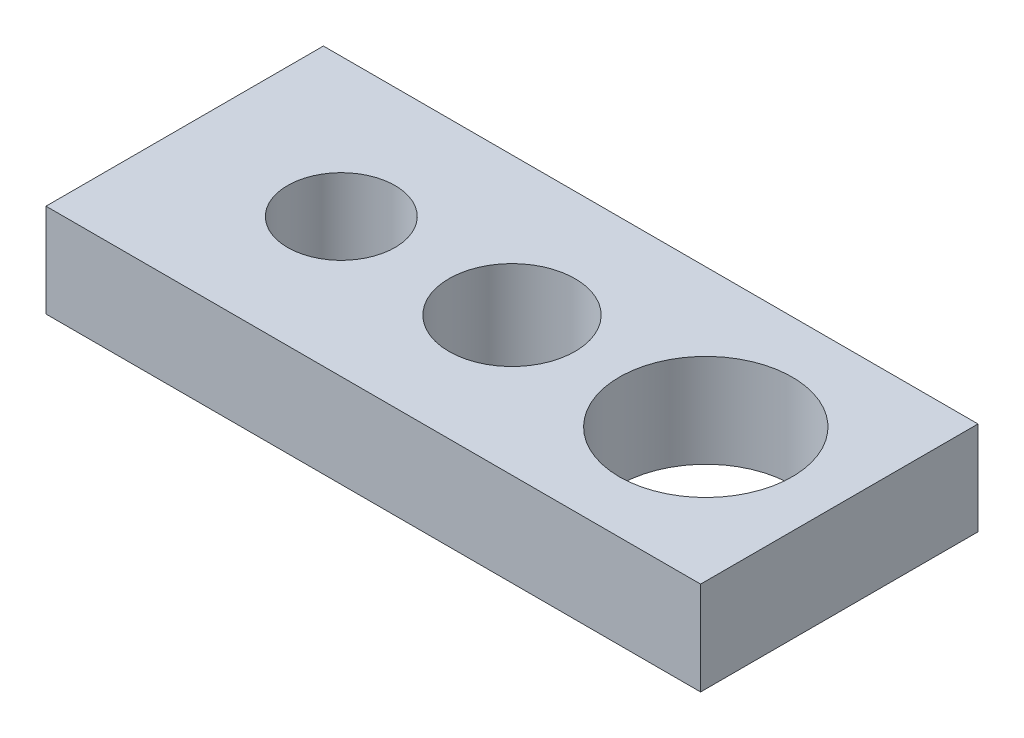
ISO-10303-21;
HEADER;
FILE_DESCRIPTION(('STEP AP214'),'2;1');
FILE_NAME('part.step','',(''),(''),'','','');
FILE_SCHEMA(('AUTOMOTIVE_DESIGN { 1 0 10303 214 1 1 1 1 }'));
ENDSEC;
DATA;
#1=APPLICATION_CONTEXT('core data for automotive mechanical design processes');
#2=APPLICATION_PROTOCOL_DEFINITION('international standard','automotive_design',2000,#1);
#3=PRODUCT_CONTEXT('',#1,'mechanical');
#4=PRODUCT('Part','Part','',(#3));
#5=PRODUCT_RELATED_PRODUCT_CATEGORY('part','',(#4));
#6=PRODUCT_DEFINITION_FORMATION('','',#4);
#7=PRODUCT_DEFINITION_CONTEXT('part definition',#1,'design');
#8=PRODUCT_DEFINITION('design','',#6,#7);
#9=PRODUCT_DEFINITION_SHAPE('','',#8);
#10=(LENGTH_UNIT() NAMED_UNIT(*) SI_UNIT(.MILLI.,.METRE.));
#11=(NAMED_UNIT(*) PLANE_ANGLE_UNIT() SI_UNIT($,.RADIAN.));
#12=(NAMED_UNIT(*) SI_UNIT($,.STERADIAN.) SOLID_ANGLE_UNIT());
#13=UNCERTAINTY_MEASURE_WITH_UNIT(LENGTH_MEASURE(1.E-05),#10,'distance_accuracy_value','');
#14=(GEOMETRIC_REPRESENTATION_CONTEXT(3) GLOBAL_UNCERTAINTY_ASSIGNED_CONTEXT((#13)) GLOBAL_UNIT_ASSIGNED_CONTEXT((#10,
#11,#12)) REPRESENTATION_CONTEXT('',''));
#15=CARTESIAN_POINT('',(0.,0.,0.));
#16=DIRECTION('',(0.,0.,1.));
#17=DIRECTION('',(1.,0.,0.));
#18=AXIS2_PLACEMENT_3D('',#15,#16,#17);
#19=CARTESIAN_POINT('',(0.,2.,0.));
#20=DIRECTION('',(0.,1.,0.));
#21=DIRECTION('',(0.,0.,1.));
#22=AXIS2_PLACEMENT_3D('',#19,#20,#21);
#23=PLANE('',#22);
#24=CARTESIAN_POINT('',(0.,2.,0.));
#25=DIRECTION('',(0.,1.,0.));
#26=DIRECTION('',(0.,0.,1.));
#27=AXIS2_PLACEMENT_3D('',#24,#25,#26);
#28=CIRCLE('',#27,1.35);
#29=CARTESIAN_POINT('',(0.,2.,1.35));
#30=VERTEX_POINT('',#29);
#31=EDGE_CURVE('E134',#30,#30,#28,.T.);
#32=ORIENTED_EDGE('',*,*,#31,.F.);
#33=EDGE_LOOP('',(#32));
#34=FACE_BOUND('',#33,.T.);
#35=DIRECTION('',(0.,0.,-1.));
#36=VECTOR('',#35,1.);
#37=CARTESIAN_POINT('',(7.00569419664908,2.,-2.96881271883403));
#38=LINE('',#37,#36);
#39=CARTESIAN_POINT('',(7.00569419664908,2.,2.96881271883403));
#40=VERTEX_POINT('',#39);
#41=CARTESIAN_POINT('',(7.00569419664908,2.,-2.96881271883403));
#42=VERTEX_POINT('',#41);
#43=EDGE_CURVE('E92',#40,#42,#38,.T.);
#44=ORIENTED_EDGE('',*,*,#43,.T.);
#45=DIRECTION('',(-1.,0.,0.));
#46=VECTOR('',#45,1.);
#47=CARTESIAN_POINT('',(-7.00569419664908,2.,-2.96881271883403));
#48=LINE('',#47,#46);
#49=CARTESIAN_POINT('',(-7.00569419664908,2.,-2.96881271883403));
#50=VERTEX_POINT('',#49);
#51=EDGE_CURVE('E87',#42,#50,#48,.T.);
#52=ORIENTED_EDGE('',*,*,#51,.T.);
#53=DIRECTION('',(0.,0.,1.));
#54=VECTOR('',#53,1.);
#55=CARTESIAN_POINT('',(-7.00569419664908,2.,-2.96881271883403));
#56=LINE('',#55,#54);
#57=CARTESIAN_POINT('',(-7.00569419664908,2.,2.96881271883403));
#58=VERTEX_POINT('',#57);
#59=EDGE_CURVE('E90',#50,#58,#56,.T.);
#60=ORIENTED_EDGE('',*,*,#59,.T.);
#61=DIRECTION('',(1.,0.,0.));
#62=VECTOR('',#61,1.);
#63=CARTESIAN_POINT('',(-7.00569419664908,2.,2.96881271883403));
#64=LINE('',#63,#62);
#65=EDGE_CURVE('E57',#58,#40,#64,.T.);
#66=ORIENTED_EDGE('',*,*,#65,.T.);
#67=EDGE_LOOP('',(#44,#52,#60,#66));
#68=FACE_BOUND('',#67,.T.);
#69=CARTESIAN_POINT('',(-3.65384268392532,2.,0.));
#70=DIRECTION('',(0.,1.,0.));
#71=DIRECTION('',(0.,0.,1.));
#72=AXIS2_PLACEMENT_3D('',#69,#70,#71);
#73=CIRCLE('',#72,1.15);
#74=CARTESIAN_POINT('',(-3.65384268392532,2.,1.15));
#75=VERTEX_POINT('',#74);
#76=EDGE_CURVE('E112',#75,#75,#73,.T.);
#77=ORIENTED_EDGE('',*,*,#76,.F.);
#78=EDGE_LOOP('',(#77));
#79=FACE_BOUND('',#78,.T.);
#80=CARTESIAN_POINT('',(4.14788066465585,2.,0.));
#81=DIRECTION('',(0.,1.,0.));
#82=DIRECTION('',(0.,0.,1.));
#83=AXIS2_PLACEMENT_3D('',#80,#81,#82);
#84=CIRCLE('',#83,1.85);
#85=CARTESIAN_POINT('',(4.14788066465585,2.,1.85));
#86=VERTEX_POINT('',#85);
#87=EDGE_CURVE('E142',#86,#86,#84,.T.);
#88=ORIENTED_EDGE('',*,*,#87,.F.);
#89=EDGE_LOOP('',(#88));
#90=FACE_BOUND('',#89,.T.);
#91=ADVANCED_FACE('F39',(#34,#68,#79,#90),#23,.T.);
#92=CARTESIAN_POINT('',(0.,0.,0.));
#93=DIRECTION('',(0.,1.,0.));
#94=DIRECTION('',(0.,0.,1.));
#95=AXIS2_PLACEMENT_3D('',#92,#93,#94);
#96=PLANE('',#95);
#97=DIRECTION('',(0.,0.,-1.));
#98=VECTOR('',#97,1.);
#99=CARTESIAN_POINT('',(7.00569419664908,0.,-2.96881271883403));
#100=LINE('',#99,#98);
#101=CARTESIAN_POINT('',(7.00569419664908,0.,2.96881271883403));
#102=VERTEX_POINT('',#101);
#103=CARTESIAN_POINT('',(7.00569419664908,0.,-2.96881271883403));
#104=VERTEX_POINT('',#103);
#105=EDGE_CURVE('E108',#102,#104,#100,.T.);
#106=ORIENTED_EDGE('',*,*,#105,.F.);
#107=DIRECTION('',(1.,0.,0.));
#108=VECTOR('',#107,1.);
#109=CARTESIAN_POINT('',(-7.00569419664908,0.,2.96881271883403));
#110=LINE('',#109,#108);
#111=CARTESIAN_POINT('',(-7.00569419664908,0.,2.96881271883403));
#112=VERTEX_POINT('',#111);
#113=EDGE_CURVE('E80',#112,#102,#110,.T.);
#114=ORIENTED_EDGE('',*,*,#113,.F.);
#115=DIRECTION('',(0.,0.,1.));
#116=VECTOR('',#115,1.);
#117=CARTESIAN_POINT('',(-7.00569419664908,0.,-2.96881271883403));
#118=LINE('',#117,#116);
#119=CARTESIAN_POINT('',(-7.00569419664908,0.,-2.96881271883403));
#120=VERTEX_POINT('',#119);
#121=EDGE_CURVE('E74',#120,#112,#118,.T.);
#122=ORIENTED_EDGE('',*,*,#121,.F.);
#123=DIRECTION('',(-1.,0.,0.));
#124=VECTOR('',#123,1.);
#125=CARTESIAN_POINT('',(-7.00569419664908,0.,-2.96881271883403));
#126=LINE('',#125,#124);
#127=EDGE_CURVE('E97',#104,#120,#126,.T.);
#128=ORIENTED_EDGE('',*,*,#127,.F.);
#129=EDGE_LOOP('',(#106,#114,#122,#128));
#130=FACE_BOUND('',#129,.T.);
#131=CARTESIAN_POINT('',(-3.65384268392532,0.,0.));
#132=DIRECTION('',(0.,1.,0.));
#133=DIRECTION('',(0.,0.,1.));
#134=AXIS2_PLACEMENT_3D('',#131,#132,#133);
#135=CIRCLE('',#134,1.15);
#136=CARTESIAN_POINT('',(-3.65384268392532,0.,1.15));
#137=VERTEX_POINT('',#136);
#138=EDGE_CURVE('E130',#137,#137,#135,.T.);
#139=ORIENTED_EDGE('',*,*,#138,.T.);
#140=EDGE_LOOP('',(#139));
#141=FACE_BOUND('',#140,.T.);
#142=CARTESIAN_POINT('',(0.,0.,0.));
#143=DIRECTION('',(0.,1.,0.));
#144=DIRECTION('',(0.,0.,1.));
#145=AXIS2_PLACEMENT_3D('',#142,#143,#144);
#146=CIRCLE('',#145,1.35);
#147=CARTESIAN_POINT('',(0.,0.,1.35));
#148=VERTEX_POINT('',#147);
#149=EDGE_CURVE('E138',#148,#148,#146,.T.);
#150=ORIENTED_EDGE('',*,*,#149,.T.);
#151=EDGE_LOOP('',(#150));
#152=FACE_BOUND('',#151,.T.);
#153=CARTESIAN_POINT('',(4.14788066465585,0.,0.));
#154=DIRECTION('',(0.,1.,0.));
#155=DIRECTION('',(0.,0.,1.));
#156=AXIS2_PLACEMENT_3D('',#153,#154,#155);
#157=CIRCLE('',#156,1.85);
#158=CARTESIAN_POINT('',(4.14788066465585,0.,1.85));
#159=VERTEX_POINT('',#158);
#160=EDGE_CURVE('E146',#159,#159,#157,.T.);
#161=ORIENTED_EDGE('',*,*,#160,.T.);
#162=EDGE_LOOP('',(#161));
#163=FACE_BOUND('',#162,.T.);
#164=ADVANCED_FACE('F125',(#130,#141,#152,#163),#96,.F.);
#165=CARTESIAN_POINT('',(7.00569419664908,2.,-2.96881271883403));
#166=DIRECTION('',(-1.,0.,0.));
#167=DIRECTION('',(0.,0.,1.));
#168=AXIS2_PLACEMENT_3D('',#165,#166,#167);
#169=PLANE('',#168);
#170=ORIENTED_EDGE('',*,*,#105,.T.);
#171=DIRECTION('',(0.,-1.,0.));
#172=VECTOR('',#171,1.);
#173=CARTESIAN_POINT('',(7.00569419664908,2.,-2.96881271883403));
#174=LINE('',#173,#172);
#175=EDGE_CURVE('E11',#42,#104,#174,.T.);
#176=ORIENTED_EDGE('',*,*,#175,.F.);
#177=ORIENTED_EDGE('',*,*,#43,.F.);
#178=DIRECTION('',(0.,-1.,0.));
#179=VECTOR('',#178,1.);
#180=CARTESIAN_POINT('',(7.00569419664908,2.,2.96881271883403));
#181=LINE('',#180,#179);
#182=EDGE_CURVE('E104',#40,#102,#181,.T.);
#183=ORIENTED_EDGE('',*,*,#182,.T.);
#184=EDGE_LOOP('',(#170,#176,#177,#183));
#185=FACE_BOUND('',#184,.T.);
#186=ADVANCED_FACE('F41',(#185),#169,.F.);
#187=CARTESIAN_POINT('',(-7.00569419664908,2.,-2.96881271883403));
#188=DIRECTION('',(0.,0.,1.));
#189=DIRECTION('',(1.,0.,0.));
#190=AXIS2_PLACEMENT_3D('',#187,#188,#189);
#191=PLANE('',#190);
#192=ORIENTED_EDGE('',*,*,#127,.T.);
#193=DIRECTION('',(0.,-1.,0.));
#194=VECTOR('',#193,1.);
#195=CARTESIAN_POINT('',(-7.00569419664908,2.,-2.96881271883403));
#196=LINE('',#195,#194);
#197=EDGE_CURVE('E49',#50,#120,#196,.T.);
#198=ORIENTED_EDGE('',*,*,#197,.F.);
#199=ORIENTED_EDGE('',*,*,#51,.F.);
#200=ORIENTED_EDGE('',*,*,#175,.T.);
#201=EDGE_LOOP('',(#192,#198,#199,#200));
#202=FACE_BOUND('',#201,.T.);
#203=ADVANCED_FACE('F96',(#202),#191,.F.);
#204=CARTESIAN_POINT('',(-7.00569419664908,2.,-2.96881271883403));
#205=DIRECTION('',(1.,0.,0.));
#206=DIRECTION('',(0.,0.,-1.));
#207=AXIS2_PLACEMENT_3D('',#204,#205,#206);
#208=PLANE('',#207);
#209=ORIENTED_EDGE('',*,*,#121,.T.);
#210=DIRECTION('',(0.,-1.,0.));
#211=VECTOR('',#210,1.);
#212=CARTESIAN_POINT('',(-7.00569419664908,2.,2.96881271883403));
#213=LINE('',#212,#211);
#214=EDGE_CURVE('E99',#58,#112,#213,.T.);
#215=ORIENTED_EDGE('',*,*,#214,.F.);
#216=ORIENTED_EDGE('',*,*,#59,.F.);
#217=ORIENTED_EDGE('',*,*,#197,.T.);
#218=EDGE_LOOP('',(#209,#215,#216,#217));
#219=FACE_BOUND('',#218,.T.);
#220=ADVANCED_FACE('F100',(#219),#208,.F.);
#221=CARTESIAN_POINT('',(-7.00569419664908,2.,2.96881271883403));
#222=DIRECTION('',(0.,0.,-1.));
#223=DIRECTION('',(-1.,0.,0.));
#224=AXIS2_PLACEMENT_3D('',#221,#222,#223);
#225=PLANE('',#224);
#226=ORIENTED_EDGE('',*,*,#113,.T.);
#227=ORIENTED_EDGE('',*,*,#182,.F.);
#228=ORIENTED_EDGE('',*,*,#65,.F.);
#229=ORIENTED_EDGE('',*,*,#214,.T.);
#230=EDGE_LOOP('',(#226,#227,#228,#229));
#231=FACE_BOUND('',#230,.T.);
#232=ADVANCED_FACE('F122',(#231),#225,.F.);
#233=CARTESIAN_POINT('',(-3.65384268392532,2.,0.));
#234=DIRECTION('',(0.,-1.,0.));
#235=DIRECTION('',(0.,0.,-1.));
#236=AXIS2_PLACEMENT_3D('',#233,#234,#235);
#237=CYLINDRICAL_SURFACE('',#236,1.15);
#238=ORIENTED_EDGE('',*,*,#76,.T.);
#239=EDGE_LOOP('',(#238));
#240=FACE_BOUND('',#239,.T.);
#241=ORIENTED_EDGE('',*,*,#138,.F.);
#242=EDGE_LOOP('',(#241));
#243=FACE_BOUND('',#242,.T.);
#244=ADVANCED_FACE('F166',(#240,#243),#237,.F.);
#245=CARTESIAN_POINT('',(0.,2.,0.));
#246=DIRECTION('',(0.,-1.,0.));
#247=DIRECTION('',(0.,0.,-1.));
#248=AXIS2_PLACEMENT_3D('',#245,#246,#247);
#249=CYLINDRICAL_SURFACE('',#248,1.35);
#250=ORIENTED_EDGE('',*,*,#31,.T.);
#251=EDGE_LOOP('',(#250));
#252=FACE_BOUND('',#251,.T.);
#253=ORIENTED_EDGE('',*,*,#149,.F.);
#254=EDGE_LOOP('',(#253));
#255=FACE_BOUND('',#254,.T.);
#256=ADVANCED_FACE('F212',(#252,#255),#249,.F.);
#257=CARTESIAN_POINT('',(4.14788066465585,2.,0.));
#258=DIRECTION('',(0.,-1.,0.));
#259=DIRECTION('',(0.,0.,-1.));
#260=AXIS2_PLACEMENT_3D('',#257,#258,#259);
#261=CYLINDRICAL_SURFACE('',#260,1.85);
#262=ORIENTED_EDGE('',*,*,#87,.T.);
#263=EDGE_LOOP('',(#262));
#264=FACE_BOUND('',#263,.T.);
#265=ORIENTED_EDGE('',*,*,#160,.F.);
#266=EDGE_LOOP('',(#265));
#267=FACE_BOUND('',#266,.T.);
#268=ADVANCED_FACE('F154',(#264,#267),#261,.F.);
#269=CLOSED_SHELL('',(#91,#164,#186,#203,#220,#232,#244,#256,#268));
#270=MANIFOLD_SOLID_BREP('B2',#269);
#271=ADVANCED_BREP_SHAPE_REPRESENTATION('',(#18,#270),#14);
#272=SHAPE_DEFINITION_REPRESENTATION(#9,#271);
ENDSEC;
END-ISO-10303-21;
